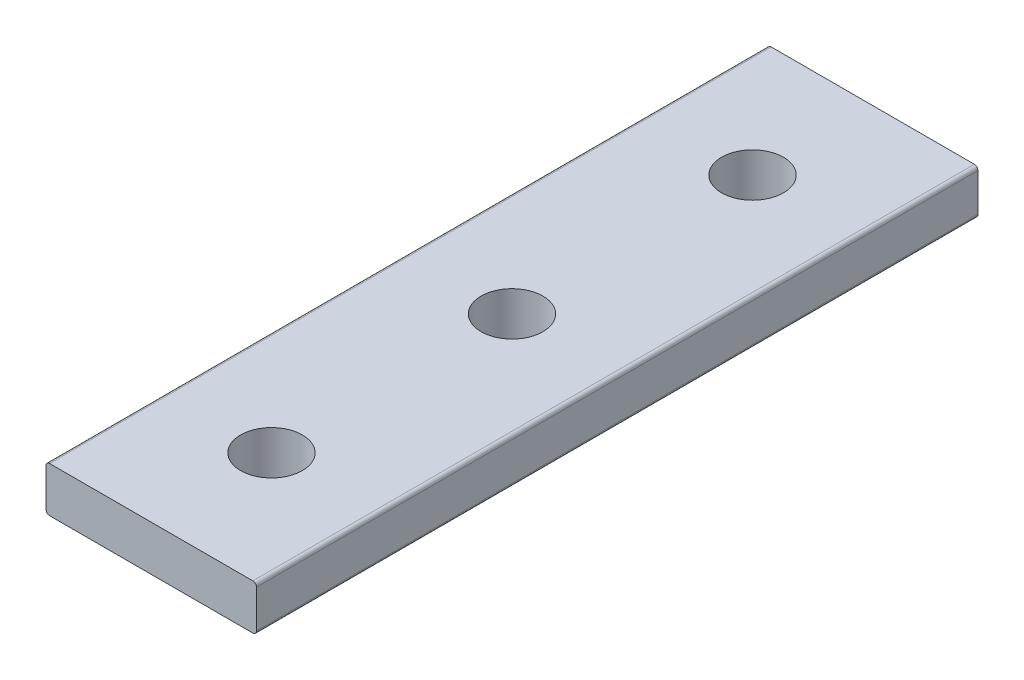
ISO-10303-21;
HEADER;
FILE_DESCRIPTION(('STEP AP214'),'2;1');
FILE_NAME('part.step','',(''),(''),'','','');
FILE_SCHEMA(('AUTOMOTIVE_DESIGN { 1 0 10303 214 1 1 1 1 }'));
ENDSEC;
DATA;
#1=APPLICATION_CONTEXT('core data for automotive mechanical design processes');
#2=APPLICATION_PROTOCOL_DEFINITION('international standard','automotive_design',2000,#1);
#3=PRODUCT_CONTEXT('',#1,'mechanical');
#4=PRODUCT('Part','Part','',(#3));
#5=PRODUCT_RELATED_PRODUCT_CATEGORY('part','',(#4));
#6=PRODUCT_DEFINITION_FORMATION('','',#4);
#7=PRODUCT_DEFINITION_CONTEXT('part definition',#1,'design');
#8=PRODUCT_DEFINITION('design','',#6,#7);
#9=PRODUCT_DEFINITION_SHAPE('','',#8);
#10=(LENGTH_UNIT() NAMED_UNIT(*) SI_UNIT(.MILLI.,.METRE.));
#11=(NAMED_UNIT(*) PLANE_ANGLE_UNIT() SI_UNIT($,.RADIAN.));
#12=(NAMED_UNIT(*) SI_UNIT($,.STERADIAN.) SOLID_ANGLE_UNIT());
#13=UNCERTAINTY_MEASURE_WITH_UNIT(LENGTH_MEASURE(1.E-05),#10,'distance_accuracy_value','');
#14=(GEOMETRIC_REPRESENTATION_CONTEXT(3) GLOBAL_UNCERTAINTY_ASSIGNED_CONTEXT((#13)) GLOBAL_UNIT_ASSIGNED_CONTEXT((#10,
#11,#12)) REPRESENTATION_CONTEXT('',''));
#15=CARTESIAN_POINT('',(0.,0.,0.));
#16=DIRECTION('',(0.,0.,1.));
#17=DIRECTION('',(1.,0.,0.));
#18=AXIS2_PLACEMENT_3D('',#15,#16,#17);
#19=CARTESIAN_POINT('',(22.225,0.,76.2));
#20=DIRECTION('',(1.,0.,0.));
#21=DIRECTION('',(0.,0.,-1.));
#22=AXIS2_PLACEMENT_3D('',#19,#20,#21);
#23=PLANE('',#22);
#24=DIRECTION('',(0.,1.,0.));
#25=VECTOR('',#24,1.);
#26=CARTESIAN_POINT('',(22.225,0.,76.2));
#27=LINE('',#26,#25);
#28=CARTESIAN_POINT('',(22.225,0.380999999999988,76.2));
#29=VERTEX_POINT('',#28);
#30=CARTESIAN_POINT('',(22.225,4.39420000000001,76.2));
#31=VERTEX_POINT('',#30);
#32=EDGE_CURVE('E106',#29,#31,#27,.T.);
#33=ORIENTED_EDGE('',*,*,#32,.F.);
#34=DIRECTION('',(0.,0.,-1.));
#35=VECTOR('',#34,1.);
#36=CARTESIAN_POINT('',(22.225,0.380999999999988,0.));
#37=LINE('',#36,#35);
#38=CARTESIAN_POINT('',(22.225,0.380999999999988,0.));
#39=VERTEX_POINT('',#38);
#40=EDGE_CURVE('E118',#29,#39,#37,.T.);
#41=ORIENTED_EDGE('',*,*,#40,.T.);
#42=DIRECTION('',(0.,1.,0.));
#43=VECTOR('',#42,1.);
#44=CARTESIAN_POINT('',(22.225,0.,0.));
#45=LINE('',#44,#43);
#46=CARTESIAN_POINT('',(22.225,4.39420000000001,0.));
#47=VERTEX_POINT('',#46);
#48=EDGE_CURVE('E170',#39,#47,#45,.T.);
#49=ORIENTED_EDGE('',*,*,#48,.T.);
#50=DIRECTION('',(0.,0.,-1.));
#51=VECTOR('',#50,1.);
#52=CARTESIAN_POINT('',(22.225,4.39420000000001,76.2));
#53=LINE('',#52,#51);
#54=EDGE_CURVE('E121',#47,#31,#53,.F.);
#55=ORIENTED_EDGE('',*,*,#54,.T.);
#56=EDGE_LOOP('',(#33,#41,#49,#55));
#57=FACE_BOUND('',#56,.T.);
#58=ADVANCED_FACE('F36',(#57),#23,.T.);
#59=CARTESIAN_POINT('',(0.,0.,76.2));
#60=DIRECTION('',(0.,0.,1.));
#61=DIRECTION('',(1.,0.,0.));
#62=AXIS2_PLACEMENT_3D('',#59,#60,#61);
#63=PLANE('',#62);
#64=DIRECTION('',(1.,0.,0.));
#65=VECTOR('',#64,1.);
#66=CARTESIAN_POINT('',(0.,0.,76.2));
#67=LINE('',#66,#65);
#68=CARTESIAN_POINT('',(0.380999999999988,0.,76.2));
#69=VERTEX_POINT('',#68);
#70=CARTESIAN_POINT('',(21.844,0.,76.2));
#71=VERTEX_POINT('',#70);
#72=EDGE_CURVE('E109',#69,#71,#67,.T.);
#73=ORIENTED_EDGE('',*,*,#72,.T.);
#74=CARTESIAN_POINT('',(21.844,0.380999999999988,76.2));
#75=DIRECTION('',(0.,0.,1.));
#76=DIRECTION('',(1.,0.,0.));
#77=AXIS2_PLACEMENT_3D('',#74,#75,#76);
#78=CIRCLE('',#77,0.380999999999988);
#79=EDGE_CURVE('E103',#71,#29,#78,.T.);
#80=ORIENTED_EDGE('',*,*,#79,.T.);
#81=ORIENTED_EDGE('',*,*,#32,.T.);
#82=CARTESIAN_POINT('',(21.844,4.39420000000001,76.2));
#83=DIRECTION('',(0.,0.,1.));
#84=DIRECTION('',(1.,0.,0.));
#85=AXIS2_PLACEMENT_3D('',#82,#83,#84);
#86=CIRCLE('',#85,0.380999999999988);
#87=CARTESIAN_POINT('',(21.844,4.7752,76.2));
#88=VERTEX_POINT('',#87);
#89=EDGE_CURVE('E142',#31,#88,#86,.T.);
#90=ORIENTED_EDGE('',*,*,#89,.T.);
#91=DIRECTION('',(1.,0.,0.));
#92=VECTOR('',#91,1.);
#93=CARTESIAN_POINT('',(0.,4.7752,76.2));
#94=LINE('',#93,#92);
#95=CARTESIAN_POINT('',(0.380999999999988,4.7752,76.2));
#96=VERTEX_POINT('',#95);
#97=EDGE_CURVE('E153',#96,#88,#94,.T.);
#98=ORIENTED_EDGE('',*,*,#97,.F.);
#99=CARTESIAN_POINT('',(0.380999999999988,4.39420000000001,76.2));
#100=DIRECTION('',(0.,0.,1.));
#101=DIRECTION('',(1.,0.,0.));
#102=AXIS2_PLACEMENT_3D('',#99,#100,#101);
#103=CIRCLE('',#102,0.380999999999988);
#104=CARTESIAN_POINT('',(0.,4.39420000000001,76.2));
#105=VERTEX_POINT('',#104);
#106=EDGE_CURVE('E51',#96,#105,#103,.T.);
#107=ORIENTED_EDGE('',*,*,#106,.T.);
#108=DIRECTION('',(0.,1.,0.));
#109=VECTOR('',#108,1.);
#110=CARTESIAN_POINT('',(0.,0.,76.2));
#111=LINE('',#110,#109);
#112=CARTESIAN_POINT('',(0.,0.380999999999988,76.2));
#113=VERTEX_POINT('',#112);
#114=EDGE_CURVE('E122',#113,#105,#111,.T.);
#115=ORIENTED_EDGE('',*,*,#114,.F.);
#116=CARTESIAN_POINT('',(0.380999999999988,0.380999999999988,76.2));
#117=DIRECTION('',(0.,0.,1.));
#118=DIRECTION('',(1.,0.,0.));
#119=AXIS2_PLACEMENT_3D('',#116,#117,#118);
#120=CIRCLE('',#119,0.380999999999988);
#121=EDGE_CURVE('E59',#113,#69,#120,.T.);
#122=ORIENTED_EDGE('',*,*,#121,.T.);
#123=EDGE_LOOP('',(#73,#80,#81,#90,#98,#107,#115,#122));
#124=FACE_BOUND('',#123,.T.);
#125=ADVANCED_FACE('F105',(#124),#63,.T.);
#126=CARTESIAN_POINT('',(0.,0.,0.));
#127=DIRECTION('',(-1.,0.,0.));
#128=DIRECTION('',(0.,0.,1.));
#129=AXIS2_PLACEMENT_3D('',#126,#127,#128);
#130=PLANE('',#129);
#131=DIRECTION('',(0.,1.,0.));
#132=VECTOR('',#131,1.);
#133=CARTESIAN_POINT('',(0.,0.,0.));
#134=LINE('',#133,#132);
#135=CARTESIAN_POINT('',(0.,0.380999999999988,0.));
#136=VERTEX_POINT('',#135);
#137=CARTESIAN_POINT('',(0.,4.39420000000001,0.));
#138=VERTEX_POINT('',#137);
#139=EDGE_CURVE('E168',#136,#138,#134,.T.);
#140=ORIENTED_EDGE('',*,*,#139,.F.);
#141=DIRECTION('',(0.,0.,1.));
#142=VECTOR('',#141,1.);
#143=CARTESIAN_POINT('',(0.,0.380999999999988,76.2));
#144=LINE('',#143,#142);
#145=EDGE_CURVE('E146',#136,#113,#144,.T.);
#146=ORIENTED_EDGE('',*,*,#145,.T.);
#147=ORIENTED_EDGE('',*,*,#114,.T.);
#148=DIRECTION('',(0.,0.,1.));
#149=VECTOR('',#148,1.);
#150=CARTESIAN_POINT('',(0.,4.39420000000001,0.));
#151=LINE('',#150,#149);
#152=EDGE_CURVE('E113',#105,#138,#151,.F.);
#153=ORIENTED_EDGE('',*,*,#152,.T.);
#154=EDGE_LOOP('',(#140,#146,#147,#153));
#155=FACE_BOUND('',#154,.T.);
#156=ADVANCED_FACE('F207',(#155),#130,.T.);
#157=CARTESIAN_POINT('',(22.225,0.,0.));
#158=DIRECTION('',(0.,0.,-1.));
#159=DIRECTION('',(-1.,0.,0.));
#160=AXIS2_PLACEMENT_3D('',#157,#158,#159);
#161=PLANE('',#160);
#162=ORIENTED_EDGE('',*,*,#48,.F.);
#163=CARTESIAN_POINT('',(21.844,0.380999999999988,0.));
#164=DIRECTION('',(0.,0.,-1.));
#165=DIRECTION('',(-1.,0.,0.));
#166=AXIS2_PLACEMENT_3D('',#163,#164,#165);
#167=CIRCLE('',#166,0.380999999999988);
#168=CARTESIAN_POINT('',(21.844,0.,0.));
#169=VERTEX_POINT('',#168);
#170=EDGE_CURVE('E125',#39,#169,#167,.T.);
#171=ORIENTED_EDGE('',*,*,#170,.T.);
#172=DIRECTION('',(-1.,0.,0.));
#173=VECTOR('',#172,1.);
#174=CARTESIAN_POINT('',(22.225,0.,0.));
#175=LINE('',#174,#173);
#176=CARTESIAN_POINT('',(0.380999999999989,0.,0.));
#177=VERTEX_POINT('',#176);
#178=EDGE_CURVE('E159',#169,#177,#175,.T.);
#179=ORIENTED_EDGE('',*,*,#178,.T.);
#180=CARTESIAN_POINT('',(0.380999999999988,0.380999999999988,0.));
#181=DIRECTION('',(0.,0.,-1.));
#182=DIRECTION('',(-1.,0.,0.));
#183=AXIS2_PLACEMENT_3D('',#180,#181,#182);
#184=CIRCLE('',#183,0.380999999999988);
#185=EDGE_CURVE('E134',#177,#136,#184,.T.);
#186=ORIENTED_EDGE('',*,*,#185,.T.);
#187=ORIENTED_EDGE('',*,*,#139,.T.);
#188=CARTESIAN_POINT('',(0.380999999999988,4.39420000000001,0.));
#189=DIRECTION('',(0.,0.,-1.));
#190=DIRECTION('',(-1.,0.,0.));
#191=AXIS2_PLACEMENT_3D('',#188,#189,#190);
#192=CIRCLE('',#191,0.380999999999988);
#193=CARTESIAN_POINT('',(0.380999999999989,4.7752,0.));
#194=VERTEX_POINT('',#193);
#195=EDGE_CURVE('E126',#138,#194,#192,.T.);
#196=ORIENTED_EDGE('',*,*,#195,.T.);
#197=DIRECTION('',(-1.,0.,0.));
#198=VECTOR('',#197,1.);
#199=CARTESIAN_POINT('',(22.225,4.7752,0.));
#200=LINE('',#199,#198);
#201=CARTESIAN_POINT('',(21.844,4.7752,0.));
#202=VERTEX_POINT('',#201);
#203=EDGE_CURVE('E156',#202,#194,#200,.T.);
#204=ORIENTED_EDGE('',*,*,#203,.F.);
#205=CARTESIAN_POINT('',(21.844,4.39420000000001,0.));
#206=DIRECTION('',(0.,0.,-1.));
#207=DIRECTION('',(-1.,0.,0.));
#208=AXIS2_PLACEMENT_3D('',#205,#206,#207);
#209=CIRCLE('',#208,0.380999999999988);
#210=EDGE_CURVE('E128',#202,#47,#209,.T.);
#211=ORIENTED_EDGE('',*,*,#210,.T.);
#212=EDGE_LOOP('',(#162,#171,#179,#186,#187,#196,#204,#211));
#213=FACE_BOUND('',#212,.T.);
#214=ADVANCED_FACE('F195',(#213),#161,.T.);
#215=CARTESIAN_POINT('',(0.,0.,0.));
#216=DIRECTION('',(0.,1.,0.));
#217=DIRECTION('',(0.,0.,1.));
#218=AXIS2_PLACEMENT_3D('',#215,#216,#217);
#219=PLANE('',#218);
#220=CARTESIAN_POINT('',(11.1125,0.,12.7));
#221=DIRECTION('',(0.,-1.,0.));
#222=DIRECTION('',(0.,0.,-1.));
#223=AXIS2_PLACEMENT_3D('',#220,#221,#222);
#224=CIRCLE('',#223,3.2639);
#225=CARTESIAN_POINT('',(11.1125,0.,9.4361));
#226=VERTEX_POINT('',#225);
#227=EDGE_CURVE('E186',#226,#226,#224,.T.);
#228=ORIENTED_EDGE('',*,*,#227,.F.);
#229=EDGE_LOOP('',(#228));
#230=FACE_BOUND('',#229,.T.);
#231=CARTESIAN_POINT('',(11.1125,0.,38.1));
#232=DIRECTION('',(0.,-1.,0.));
#233=DIRECTION('',(0.,0.,-1.));
#234=AXIS2_PLACEMENT_3D('',#231,#232,#233);
#235=CIRCLE('',#234,3.2639);
#236=CARTESIAN_POINT('',(11.1125,0.,34.8361));
#237=VERTEX_POINT('',#236);
#238=EDGE_CURVE('E180',#237,#237,#235,.T.);
#239=ORIENTED_EDGE('',*,*,#238,.F.);
#240=EDGE_LOOP('',(#239));
#241=FACE_BOUND('',#240,.T.);
#242=CARTESIAN_POINT('',(11.1125,0.,63.5));
#243=DIRECTION('',(0.,-1.,0.));
#244=DIRECTION('',(0.,0.,-1.));
#245=AXIS2_PLACEMENT_3D('',#242,#243,#244);
#246=CIRCLE('',#245,3.2639);
#247=CARTESIAN_POINT('',(11.1125,0.,60.2361));
#248=VERTEX_POINT('',#247);
#249=EDGE_CURVE('E174',#248,#248,#246,.T.);
#250=ORIENTED_EDGE('',*,*,#249,.F.);
#251=EDGE_LOOP('',(#250));
#252=FACE_BOUND('',#251,.T.);
#253=ORIENTED_EDGE('',*,*,#178,.F.);
#254=DIRECTION('',(0.,0.,-1.));
#255=VECTOR('',#254,1.);
#256=CARTESIAN_POINT('',(21.844,0.,76.2));
#257=LINE('',#256,#255);
#258=EDGE_CURVE('E139',#169,#71,#257,.F.);
#259=ORIENTED_EDGE('',*,*,#258,.T.);
#260=ORIENTED_EDGE('',*,*,#72,.F.);
#261=DIRECTION('',(0.,0.,1.));
#262=VECTOR('',#261,1.);
#263=CARTESIAN_POINT('',(0.380999999999988,0.,0.));
#264=LINE('',#263,#262);
#265=EDGE_CURVE('E137',#69,#177,#264,.F.);
#266=ORIENTED_EDGE('',*,*,#265,.T.);
#267=EDGE_LOOP('',(#253,#259,#260,#266));
#268=FACE_BOUND('',#267,.T.);
#269=ADVANCED_FACE('F192',(#230,#241,#252,#268),#219,.F.);
#270=CARTESIAN_POINT('',(0.,4.7752,0.));
#271=DIRECTION('',(0.,1.,0.));
#272=DIRECTION('',(0.,0.,1.));
#273=AXIS2_PLACEMENT_3D('',#270,#271,#272);
#274=PLANE('',#273);
#275=CARTESIAN_POINT('',(11.1125,4.7752,12.7));
#276=DIRECTION('',(0.,-1.,0.));
#277=DIRECTION('',(0.,0.,-1.));
#278=AXIS2_PLACEMENT_3D('',#275,#276,#277);
#279=CIRCLE('',#278,3.2639);
#280=CARTESIAN_POINT('',(11.1125,4.7752,9.43610000000001));
#281=VERTEX_POINT('',#280);
#282=EDGE_CURVE('E183',#281,#281,#279,.T.);
#283=ORIENTED_EDGE('',*,*,#282,.T.);
#284=EDGE_LOOP('',(#283));
#285=FACE_BOUND('',#284,.T.);
#286=CARTESIAN_POINT('',(11.1125,4.7752,38.1));
#287=DIRECTION('',(0.,-1.,0.));
#288=DIRECTION('',(0.,0.,-1.));
#289=AXIS2_PLACEMENT_3D('',#286,#287,#288);
#290=CIRCLE('',#289,3.2639);
#291=CARTESIAN_POINT('',(11.1125,4.7752,34.8361));
#292=VERTEX_POINT('',#291);
#293=EDGE_CURVE('E177',#292,#292,#290,.T.);
#294=ORIENTED_EDGE('',*,*,#293,.T.);
#295=EDGE_LOOP('',(#294));
#296=FACE_BOUND('',#295,.T.);
#297=CARTESIAN_POINT('',(11.1125,4.7752,63.5));
#298=DIRECTION('',(0.,-1.,0.));
#299=DIRECTION('',(0.,0.,-1.));
#300=AXIS2_PLACEMENT_3D('',#297,#298,#299);
#301=CIRCLE('',#300,3.2639);
#302=CARTESIAN_POINT('',(11.1125,4.7752,60.2361));
#303=VERTEX_POINT('',#302);
#304=EDGE_CURVE('E163',#303,#303,#301,.T.);
#305=ORIENTED_EDGE('',*,*,#304,.T.);
#306=EDGE_LOOP('',(#305));
#307=FACE_BOUND('',#306,.T.);
#308=ORIENTED_EDGE('',*,*,#97,.T.);
#309=DIRECTION('',(0.,0.,-1.));
#310=VECTOR('',#309,1.);
#311=CARTESIAN_POINT('',(21.844,4.7752,0.));
#312=LINE('',#311,#310);
#313=EDGE_CURVE('E11',#88,#202,#312,.T.);
#314=ORIENTED_EDGE('',*,*,#313,.T.);
#315=ORIENTED_EDGE('',*,*,#203,.T.);
#316=DIRECTION('',(0.,0.,1.));
#317=VECTOR('',#316,1.);
#318=CARTESIAN_POINT('',(0.380999999999988,4.7752,0.));
#319=LINE('',#318,#317);
#320=EDGE_CURVE('E44',#194,#96,#319,.T.);
#321=ORIENTED_EDGE('',*,*,#320,.T.);
#322=EDGE_LOOP('',(#308,#314,#315,#321));
#323=FACE_BOUND('',#322,.T.);
#324=ADVANCED_FACE('F152',(#285,#296,#307,#323),#274,.T.);
#325=CARTESIAN_POINT('',(11.1125,0.,63.5));
#326=DIRECTION('',(0.,-1.,0.));
#327=DIRECTION('',(0.,0.,-1.));
#328=AXIS2_PLACEMENT_3D('',#325,#326,#327);
#329=CYLINDRICAL_SURFACE('',#328,3.2639);
#330=ORIENTED_EDGE('',*,*,#304,.F.);
#331=EDGE_LOOP('',(#330));
#332=FACE_BOUND('',#331,.T.);
#333=ORIENTED_EDGE('',*,*,#249,.T.);
#334=EDGE_LOOP('',(#333));
#335=FACE_BOUND('',#334,.T.);
#336=ADVANCED_FACE('F265',(#332,#335),#329,.F.);
#337=CARTESIAN_POINT('',(11.1125,0.,38.1));
#338=DIRECTION('',(0.,-1.,0.));
#339=DIRECTION('',(0.,0.,-1.));
#340=AXIS2_PLACEMENT_3D('',#337,#338,#339);
#341=CYLINDRICAL_SURFACE('',#340,3.2639);
#342=ORIENTED_EDGE('',*,*,#293,.F.);
#343=EDGE_LOOP('',(#342));
#344=FACE_BOUND('',#343,.T.);
#345=ORIENTED_EDGE('',*,*,#238,.T.);
#346=EDGE_LOOP('',(#345));
#347=FACE_BOUND('',#346,.T.);
#348=ADVANCED_FACE('F256',(#344,#347),#341,.F.);
#349=CARTESIAN_POINT('',(11.1125,0.,12.7));
#350=DIRECTION('',(0.,-1.,0.));
#351=DIRECTION('',(0.,0.,-1.));
#352=AXIS2_PLACEMENT_3D('',#349,#350,#351);
#353=CYLINDRICAL_SURFACE('',#352,3.2639);
#354=ORIENTED_EDGE('',*,*,#282,.F.);
#355=EDGE_LOOP('',(#354));
#356=FACE_BOUND('',#355,.T.);
#357=ORIENTED_EDGE('',*,*,#227,.T.);
#358=EDGE_LOOP('',(#357));
#359=FACE_BOUND('',#358,.T.);
#360=ADVANCED_FACE('F190',(#356,#359),#353,.F.);
#361=CARTESIAN_POINT('',(21.844,0.380999999999988,76.2));
#362=DIRECTION('',(0.,0.,1.));
#363=DIRECTION('',(1.,0.,0.));
#364=AXIS2_PLACEMENT_3D('',#361,#362,#363);
#365=CYLINDRICAL_SURFACE('',#364,0.380999999999988);
#366=ORIENTED_EDGE('',*,*,#79,.F.);
#367=ORIENTED_EDGE('',*,*,#258,.F.);
#368=ORIENTED_EDGE('',*,*,#170,.F.);
#369=ORIENTED_EDGE('',*,*,#40,.F.);
#370=EDGE_LOOP('',(#366,#367,#368,#369));
#371=FACE_BOUND('',#370,.T.);
#372=ADVANCED_FACE('F124',(#371),#365,.T.);
#373=CARTESIAN_POINT('',(0.380999999999988,0.380999999999988,0.));
#374=DIRECTION('',(0.,0.,-1.));
#375=DIRECTION('',(-1.,0.,0.));
#376=AXIS2_PLACEMENT_3D('',#373,#374,#375);
#377=CYLINDRICAL_SURFACE('',#376,0.380999999999988);
#378=ORIENTED_EDGE('',*,*,#185,.F.);
#379=ORIENTED_EDGE('',*,*,#265,.F.);
#380=ORIENTED_EDGE('',*,*,#121,.F.);
#381=ORIENTED_EDGE('',*,*,#145,.F.);
#382=EDGE_LOOP('',(#378,#379,#380,#381));
#383=FACE_BOUND('',#382,.T.);
#384=ADVANCED_FACE('F205',(#383),#377,.T.);
#385=CARTESIAN_POINT('',(21.844,4.39420000000001,0.));
#386=DIRECTION('',(0.,0.,-1.));
#387=DIRECTION('',(-1.,0.,0.));
#388=AXIS2_PLACEMENT_3D('',#385,#386,#387);
#389=CYLINDRICAL_SURFACE('',#388,0.380999999999988);
#390=ORIENTED_EDGE('',*,*,#89,.F.);
#391=ORIENTED_EDGE('',*,*,#54,.F.);
#392=ORIENTED_EDGE('',*,*,#210,.F.);
#393=ORIENTED_EDGE('',*,*,#313,.F.);
#394=EDGE_LOOP('',(#390,#391,#392,#393));
#395=FACE_BOUND('',#394,.T.);
#396=ADVANCED_FACE('F210',(#395),#389,.T.);
#397=CARTESIAN_POINT('',(0.380999999999988,4.39420000000001,0.));
#398=DIRECTION('',(0.,0.,1.));
#399=DIRECTION('',(1.,0.,0.));
#400=AXIS2_PLACEMENT_3D('',#397,#398,#399);
#401=CYLINDRICAL_SURFACE('',#400,0.380999999999988);
#402=ORIENTED_EDGE('',*,*,#195,.F.);
#403=ORIENTED_EDGE('',*,*,#152,.F.);
#404=ORIENTED_EDGE('',*,*,#106,.F.);
#405=ORIENTED_EDGE('',*,*,#320,.F.);
#406=EDGE_LOOP('',(#402,#403,#404,#405));
#407=FACE_BOUND('',#406,.T.);
#408=ADVANCED_FACE('F38',(#407),#401,.T.);
#409=CLOSED_SHELL('',(#58,#125,#156,#214,#269,#324,#336,#348,#360,#372,#384,#396,#408));
#410=MANIFOLD_SOLID_BREP('B2',#409);
#411=ADVANCED_BREP_SHAPE_REPRESENTATION('',(#18,#410),#14);
#412=SHAPE_DEFINITION_REPRESENTATION(#9,#411);
ENDSEC;
END-ISO-10303-21;
